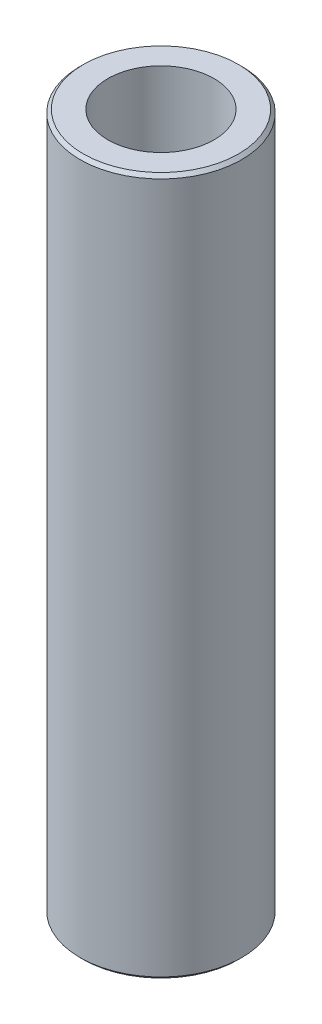
ISO-10303-21;
HEADER;
FILE_DESCRIPTION(('STEP AP214'),'2;1');
FILE_NAME('part.step','',(''),(''),'','','');
FILE_SCHEMA(('AUTOMOTIVE_DESIGN { 1 0 10303 214 1 1 1 1 }'));
ENDSEC;
DATA;
#1=APPLICATION_CONTEXT('core data for automotive mechanical design processes');
#2=APPLICATION_PROTOCOL_DEFINITION('international standard','automotive_design',2000,#1);
#3=PRODUCT_CONTEXT('',#1,'mechanical');
#4=PRODUCT('Part','Part','',(#3));
#5=PRODUCT_RELATED_PRODUCT_CATEGORY('part','',(#4));
#6=PRODUCT_DEFINITION_FORMATION('','',#4);
#7=PRODUCT_DEFINITION_CONTEXT('part definition',#1,'design');
#8=PRODUCT_DEFINITION('design','',#6,#7);
#9=PRODUCT_DEFINITION_SHAPE('','',#8);
#10=(LENGTH_UNIT() NAMED_UNIT(*) SI_UNIT(.MILLI.,.METRE.));
#11=(NAMED_UNIT(*) PLANE_ANGLE_UNIT() SI_UNIT($,.RADIAN.));
#12=(NAMED_UNIT(*) SI_UNIT($,.STERADIAN.) SOLID_ANGLE_UNIT());
#13=UNCERTAINTY_MEASURE_WITH_UNIT(LENGTH_MEASURE(1.E-05),#10,'distance_accuracy_value','');
#14=(GEOMETRIC_REPRESENTATION_CONTEXT(3) GLOBAL_UNCERTAINTY_ASSIGNED_CONTEXT((#13)) GLOBAL_UNIT_ASSIGNED_CONTEXT((#10,
#11,#12)) REPRESENTATION_CONTEXT('',''));
#15=CARTESIAN_POINT('',(0.,0.,0.));
#16=DIRECTION('',(0.,0.,1.));
#17=DIRECTION('',(1.,0.,0.));
#18=AXIS2_PLACEMENT_3D('',#15,#16,#17);
#19=CARTESIAN_POINT('',(0.,129.467311492185,0.));
#20=DIRECTION('',(0.,-1.,0.));
#21=DIRECTION('',(0.,0.,-1.));
#22=AXIS2_PLACEMENT_3D('',#19,#20,#21);
#23=CYLINDRICAL_SURFACE('',#22,15.);
#24=CARTESIAN_POINT('',(0.,128.859364723586,0.));
#25=DIRECTION('',(0.,1.,0.));
#26=DIRECTION('',(0.,0.,1.));
#27=AXIS2_PLACEMENT_3D('',#24,#25,#26);
#28=CIRCLE('',#27,15.);
#29=CARTESIAN_POINT('',(0.,128.859364723586,15.));
#30=VERTEX_POINT('',#29);
#31=EDGE_CURVE('E50',#30,#30,#28,.F.);
#32=ORIENTED_EDGE('',*,*,#31,.T.);
#33=EDGE_LOOP('',(#32));
#34=FACE_BOUND('',#33,.T.);
#35=CARTESIAN_POINT('',(0.,0.607946768598877,0.));
#36=DIRECTION('',(0.,1.,0.));
#37=DIRECTION('',(0.,0.,1.));
#38=AXIS2_PLACEMENT_3D('',#35,#36,#37);
#39=CIRCLE('',#38,15.);
#40=CARTESIAN_POINT('',(0.,0.607946768598877,15.));
#41=VERTEX_POINT('',#40);
#42=EDGE_CURVE('E51',#41,#41,#39,.T.);
#43=ORIENTED_EDGE('',*,*,#42,.T.);
#44=EDGE_LOOP('',(#43));
#45=FACE_BOUND('',#44,.T.);
#46=ADVANCED_FACE('F39',(#34,#45),#23,.T.);
#47=CARTESIAN_POINT('',(0.,129.467311492185,0.));
#48=DIRECTION('',(0.,1.,0.));
#49=DIRECTION('',(0.,0.,1.));
#50=AXIS2_PLACEMENT_3D('',#47,#48,#49);
#51=PLANE('',#50);
#52=CARTESIAN_POINT('',(0.,129.467311492185,0.));
#53=DIRECTION('',(0.,1.,0.));
#54=DIRECTION('',(0.,0.,1.));
#55=AXIS2_PLACEMENT_3D('',#52,#53,#54);
#56=CIRCLE('',#55,14.3920532314011);
#57=CARTESIAN_POINT('',(0.,129.467311492185,14.3920532314011));
#58=VERTEX_POINT('',#57);
#59=EDGE_CURVE('E54',#58,#58,#56,.T.);
#60=ORIENTED_EDGE('',*,*,#59,.T.);
#61=EDGE_LOOP('',(#60));
#62=FACE_BOUND('',#61,.T.);
#63=CARTESIAN_POINT('',(0.,129.467311492185,0.));
#64=DIRECTION('',(0.,1.,0.));
#65=DIRECTION('',(0.,0.,1.));
#66=AXIS2_PLACEMENT_3D('',#63,#64,#65);
#67=CIRCLE('',#66,9.86045498693773);
#68=CARTESIAN_POINT('',(0.,129.467311492185,9.86045498693773));
#69=VERTEX_POINT('',#68);
#70=EDGE_CURVE('E58',#69,#69,#67,.T.);
#71=ORIENTED_EDGE('',*,*,#70,.F.);
#72=EDGE_LOOP('',(#71));
#73=FACE_BOUND('',#72,.T.);
#74=ADVANCED_FACE('F69',(#62,#73),#51,.T.);
#75=CARTESIAN_POINT('',(0.,0.,0.));
#76=DIRECTION('',(0.,1.,0.));
#77=DIRECTION('',(0.,0.,1.));
#78=AXIS2_PLACEMENT_3D('',#75,#76,#77);
#79=PLANE('',#78);
#80=CARTESIAN_POINT('',(0.,0.,0.));
#81=DIRECTION('',(0.,1.,0.));
#82=DIRECTION('',(0.,0.,1.));
#83=AXIS2_PLACEMENT_3D('',#80,#81,#82);
#84=CIRCLE('',#83,14.3920532314011);
#85=CARTESIAN_POINT('',(0.,0.,14.3920532314011));
#86=VERTEX_POINT('',#85);
#87=EDGE_CURVE('E10',#86,#86,#84,.F.);
#88=ORIENTED_EDGE('',*,*,#87,.T.);
#89=EDGE_LOOP('',(#88));
#90=FACE_BOUND('',#89,.T.);
#91=CARTESIAN_POINT('',(0.,0.,0.));
#92=DIRECTION('',(0.,1.,0.));
#93=DIRECTION('',(0.,0.,1.));
#94=AXIS2_PLACEMENT_3D('',#91,#92,#93);
#95=CIRCLE('',#94,9.86045498693773);
#96=CARTESIAN_POINT('',(0.,0.,9.86045498693773));
#97=VERTEX_POINT('',#96);
#98=EDGE_CURVE('E63',#97,#97,#95,.T.);
#99=ORIENTED_EDGE('',*,*,#98,.T.);
#100=EDGE_LOOP('',(#99));
#101=FACE_BOUND('',#100,.T.);
#102=ADVANCED_FACE('F75',(#90,#101),#79,.F.);
#103=CARTESIAN_POINT('',(0.,129.467311492185,0.));
#104=DIRECTION('',(0.,-1.,0.));
#105=DIRECTION('',(0.,0.,-1.));
#106=AXIS2_PLACEMENT_3D('',#103,#104,#105);
#107=CYLINDRICAL_SURFACE('',#106,9.86045498693773);
#108=ORIENTED_EDGE('',*,*,#70,.T.);
#109=EDGE_LOOP('',(#108));
#110=FACE_BOUND('',#109,.T.);
#111=ORIENTED_EDGE('',*,*,#98,.F.);
#112=EDGE_LOOP('',(#111));
#113=FACE_BOUND('',#112,.T.);
#114=ADVANCED_FACE('F70',(#110,#113),#107,.F.);
#115=CARTESIAN_POINT('',(0.,129.467311492185,0.));
#116=DIRECTION('',(0.,-1.,0.));
#117=DIRECTION('',(0.,0.,-1.));
#118=AXIS2_PLACEMENT_3D('',#115,#116,#117);
#119=CONICAL_SURFACE('',#118,14.3920532314011,0.785398163397437);
#120=ORIENTED_EDGE('',*,*,#31,.F.);
#121=EDGE_LOOP('',(#120));
#122=FACE_BOUND('',#121,.T.);
#123=ORIENTED_EDGE('',*,*,#59,.F.);
#124=EDGE_LOOP('',(#123));
#125=FACE_BOUND('',#124,.T.);
#126=ADVANCED_FACE('F81',(#122,#125),#119,.T.);
#127=CARTESIAN_POINT('',(0.,0.607946768598877,0.));
#128=DIRECTION('',(0.,1.,0.));
#129=DIRECTION('',(0.,0.,1.));
#130=AXIS2_PLACEMENT_3D('',#127,#128,#129);
#131=CONICAL_SURFACE('',#130,15.,0.785398163397448);
#132=ORIENTED_EDGE('',*,*,#87,.F.);
#133=EDGE_LOOP('',(#132));
#134=FACE_BOUND('',#133,.T.);
#135=ORIENTED_EDGE('',*,*,#42,.F.);
#136=EDGE_LOOP('',(#135));
#137=FACE_BOUND('',#136,.T.);
#138=ADVANCED_FACE('F45',(#134,#137),#131,.T.);
#139=CLOSED_SHELL('',(#46,#74,#102,#114,#126,#138));
#140=MANIFOLD_SOLID_BREP('B2',#139);
#141=ADVANCED_BREP_SHAPE_REPRESENTATION('',(#18,#140),#14);
#142=SHAPE_DEFINITION_REPRESENTATION(#9,#141);
ENDSEC;
END-ISO-10303-21;
